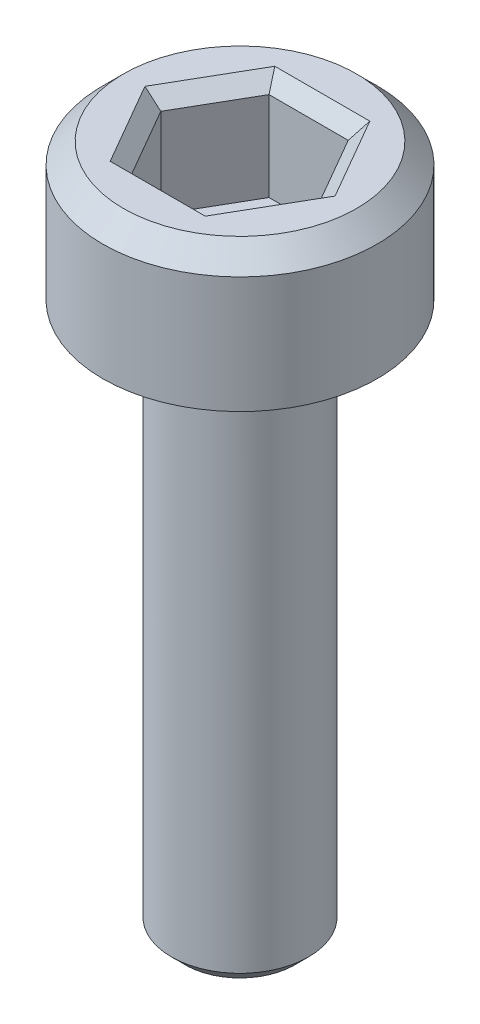
ISO-10303-21;
HEADER;
FILE_DESCRIPTION(('STEP AP214'),'2;1');
FILE_NAME('part.step','',(''),(''),'','','');
FILE_SCHEMA(('AUTOMOTIVE_DESIGN { 1 0 10303 214 1 1 1 1 }'));
ENDSEC;
DATA;
#1=APPLICATION_CONTEXT('core data for automotive mechanical design processes');
#2=APPLICATION_PROTOCOL_DEFINITION('international standard','automotive_design',2000,#1);
#3=PRODUCT_CONTEXT('',#1,'mechanical');
#4=PRODUCT('Part','Part','',(#3));
#5=PRODUCT_RELATED_PRODUCT_CATEGORY('part','',(#4));
#6=PRODUCT_DEFINITION_FORMATION('','',#4);
#7=PRODUCT_DEFINITION_CONTEXT('part definition',#1,'design');
#8=PRODUCT_DEFINITION('design','',#6,#7);
#9=PRODUCT_DEFINITION_SHAPE('','',#8);
#10=(LENGTH_UNIT() NAMED_UNIT(*) SI_UNIT(.MILLI.,.METRE.));
#11=(NAMED_UNIT(*) PLANE_ANGLE_UNIT() SI_UNIT($,.RADIAN.));
#12=(NAMED_UNIT(*) SI_UNIT($,.STERADIAN.) SOLID_ANGLE_UNIT());
#13=UNCERTAINTY_MEASURE_WITH_UNIT(LENGTH_MEASURE(1.E-05),#10,'distance_accuracy_value','');
#14=(GEOMETRIC_REPRESENTATION_CONTEXT(3) GLOBAL_UNCERTAINTY_ASSIGNED_CONTEXT((#13)) GLOBAL_UNIT_ASSIGNED_CONTEXT((#10,
#11,#12)) REPRESENTATION_CONTEXT('',''));
#15=CARTESIAN_POINT('',(0.,0.,0.));
#16=DIRECTION('',(0.,0.,1.));
#17=DIRECTION('',(1.,0.,0.));
#18=AXIS2_PLACEMENT_3D('',#15,#16,#17);
#19=CARTESIAN_POINT('',(0.,0.,0.));
#20=DIRECTION('',(0.,1.,0.));
#21=DIRECTION('',(0.,0.,1.));
#22=AXIS2_PLACEMENT_3D('',#19,#20,#21);
#23=PLANE('',#22);
#24=CARTESIAN_POINT('',(0.,0.,0.));
#25=DIRECTION('',(0.,1.,0.));
#26=DIRECTION('',(0.,0.,1.));
#27=AXIS2_PLACEMENT_3D('',#24,#25,#26);
#28=CIRCLE('',#27,2.);
#29=CARTESIAN_POINT('',(0.,0.,2.));
#30=VERTEX_POINT('',#29);
#31=EDGE_CURVE('E146',#30,#30,#28,.T.);
#32=ORIENTED_EDGE('',*,*,#31,.F.);
#33=EDGE_LOOP('',(#32));
#34=FACE_BOUND('',#33,.T.);
#35=CARTESIAN_POINT('',(0.,0.,0.));
#36=DIRECTION('',(0.,1.,0.));
#37=DIRECTION('',(0.,0.,1.));
#38=AXIS2_PLACEMENT_3D('',#35,#36,#37);
#39=CIRCLE('',#38,1.);
#40=CARTESIAN_POINT('',(0.,0.,1.));
#41=VERTEX_POINT('',#40);
#42=EDGE_CURVE('E185',#41,#41,#39,.F.);
#43=ORIENTED_EDGE('',*,*,#42,.F.);
#44=EDGE_LOOP('',(#43));
#45=FACE_BOUND('',#44,.T.);
#46=ADVANCED_FACE('F33',(#34,#45),#23,.F.);
#47=CARTESIAN_POINT('',(0.,2.,0.));
#48=DIRECTION('',(0.,-1.,0.));
#49=DIRECTION('',(0.,0.,-1.));
#50=AXIS2_PLACEMENT_3D('',#47,#48,#49);
#51=CYLINDRICAL_SURFACE('',#50,2.);
#52=CARTESIAN_POINT('',(0.,1.7,0.));
#53=DIRECTION('',(0.,1.,0.));
#54=DIRECTION('',(0.,0.,1.));
#55=AXIS2_PLACEMENT_3D('',#52,#53,#54);
#56=CIRCLE('',#55,2.);
#57=CARTESIAN_POINT('',(0.,1.7,2.));
#58=VERTEX_POINT('',#57);
#59=EDGE_CURVE('E160',#58,#58,#56,.F.);
#60=ORIENTED_EDGE('',*,*,#59,.T.);
#61=EDGE_LOOP('',(#60));
#62=FACE_BOUND('',#61,.T.);
#63=ORIENTED_EDGE('',*,*,#31,.T.);
#64=EDGE_LOOP('',(#63));
#65=FACE_BOUND('',#64,.T.);
#66=ADVANCED_FACE('F213',(#62,#65),#51,.T.);
#67=CARTESIAN_POINT('',(0.,2.,0.));
#68=DIRECTION('',(0.,1.,0.));
#69=DIRECTION('',(0.,0.,1.));
#70=AXIS2_PLACEMENT_3D('',#67,#68,#69);
#71=PLANE('',#70);
#72=DIRECTION('',(1.,0.,0.));
#73=VECTOR('',#72,1.);
#74=CARTESIAN_POINT('',(0.577350269189625,2.,-1.2));
#75=LINE('',#74,#73);
#76=CARTESIAN_POINT('',(-0.692820323027552,2.,-1.2));
#77=VERTEX_POINT('',#76);
#78=CARTESIAN_POINT('',(0.692820323027551,2.,-1.2));
#79=VERTEX_POINT('',#78);
#80=EDGE_CURVE('E165',#77,#79,#75,.T.);
#81=ORIENTED_EDGE('',*,*,#80,.T.);
#82=DIRECTION('',(0.5,0.,0.866025403784438));
#83=VECTOR('',#82,1.);
#84=CARTESIAN_POINT('',(1.32790561913614,2.,-0.100000000000001));
#85=LINE('',#84,#83);
#86=CARTESIAN_POINT('',(1.3856406460551,2.,0.));
#87=VERTEX_POINT('',#86);
#88=EDGE_CURVE('E175',#79,#87,#85,.T.);
#89=ORIENTED_EDGE('',*,*,#88,.T.);
#90=DIRECTION('',(-0.5,0.,0.866025403784439));
#91=VECTOR('',#90,1.);
#92=CARTESIAN_POINT('',(0.750555349946515,2.,1.1));
#93=LINE('',#92,#91);
#94=CARTESIAN_POINT('',(0.692820323027551,2.,1.2));
#95=VERTEX_POINT('',#94);
#96=EDGE_CURVE('E173',#87,#95,#93,.T.);
#97=ORIENTED_EDGE('',*,*,#96,.T.);
#98=DIRECTION('',(-1.,0.,0.));
#99=VECTOR('',#98,1.);
#100=CARTESIAN_POINT('',(-0.577350269189626,2.,1.2));
#101=LINE('',#100,#99);
#102=CARTESIAN_POINT('',(-0.692820323027551,2.,1.2));
#103=VERTEX_POINT('',#102);
#104=EDGE_CURVE('E171',#95,#103,#101,.T.);
#105=ORIENTED_EDGE('',*,*,#104,.T.);
#106=DIRECTION('',(-0.5,0.,-0.866025403784439));
#107=VECTOR('',#106,1.);
#108=CARTESIAN_POINT('',(-1.32790561913614,2.,0.100000000000001));
#109=LINE('',#108,#107);
#110=CARTESIAN_POINT('',(-1.3856406460551,2.,0.));
#111=VERTEX_POINT('',#110);
#112=EDGE_CURVE('E169',#103,#111,#109,.T.);
#113=ORIENTED_EDGE('',*,*,#112,.T.);
#114=DIRECTION('',(0.5,0.,-0.866025403784439));
#115=VECTOR('',#114,1.);
#116=CARTESIAN_POINT('',(-0.750555349946515,2.,-1.1));
#117=LINE('',#116,#115);
#118=EDGE_CURVE('E167',#111,#77,#117,.T.);
#119=ORIENTED_EDGE('',*,*,#118,.T.);
#120=EDGE_LOOP('',(#81,#89,#97,#105,#113,#119));
#121=FACE_BOUND('',#120,.T.);
#122=CARTESIAN_POINT('',(0.,2.,0.));
#123=DIRECTION('',(0.,1.,0.));
#124=DIRECTION('',(0.,0.,1.));
#125=AXIS2_PLACEMENT_3D('',#122,#123,#124);
#126=CIRCLE('',#125,1.7);
#127=CARTESIAN_POINT('',(0.,2.,1.7));
#128=VERTEX_POINT('',#127);
#129=EDGE_CURVE('E157',#128,#128,#126,.T.);
#130=ORIENTED_EDGE('',*,*,#129,.T.);
#131=EDGE_LOOP('',(#130));
#132=FACE_BOUND('',#131,.T.);
#133=ADVANCED_FACE('F219',(#121,#132),#71,.T.);
#134=CARTESIAN_POINT('',(0.,2.,0.));
#135=DIRECTION('',(0.,-1.,0.));
#136=DIRECTION('',(0.,0.,-1.));
#137=AXIS2_PLACEMENT_3D('',#134,#135,#136);
#138=CONICAL_SURFACE('',#137,1.7,0.785398163397447);
#139=ORIENTED_EDGE('',*,*,#59,.F.);
#140=EDGE_LOOP('',(#139));
#141=FACE_BOUND('',#140,.T.);
#142=ORIENTED_EDGE('',*,*,#129,.F.);
#143=EDGE_LOOP('',(#142));
#144=FACE_BOUND('',#143,.T.);
#145=ADVANCED_FACE('F227',(#141,#144),#138,.T.);
#146=CARTESIAN_POINT('',(0.577350269189626,0.5,1.));
#147=DIRECTION('',(0.866025403784439,0.,0.5));
#148=DIRECTION('',(0.5,0.,-0.866025403784439));
#149=AXIS2_PLACEMENT_3D('',#146,#147,#148);
#150=PLANE('',#149);
#151=DIRECTION('',(0.,1.,0.));
#152=VECTOR('',#151,1.);
#153=CARTESIAN_POINT('',(0.577350269189626,0.5,1.));
#154=LINE('',#153,#152);
#155=CARTESIAN_POINT('',(0.577350269189626,0.5,1.));
#156=VERTEX_POINT('',#155);
#157=CARTESIAN_POINT('',(0.577350269189626,1.8,1.));
#158=VERTEX_POINT('',#157);
#159=EDGE_CURVE('E144',#156,#158,#154,.T.);
#160=ORIENTED_EDGE('',*,*,#159,.T.);
#161=DIRECTION('',(0.5,0.,-0.866025403784439));
#162=VECTOR('',#161,1.);
#163=CARTESIAN_POINT('',(1.15470053837925,1.8,0.));
#164=LINE('',#163,#162);
#165=CARTESIAN_POINT('',(1.15470053837925,1.8,0.));
#166=VERTEX_POINT('',#165);
#167=EDGE_CURVE('E113',#158,#166,#164,.T.);
#168=ORIENTED_EDGE('',*,*,#167,.T.);
#169=DIRECTION('',(0.,1.,0.));
#170=VECTOR('',#169,1.);
#171=CARTESIAN_POINT('',(1.15470053837925,0.5,0.));
#172=LINE('',#171,#170);
#173=CARTESIAN_POINT('',(1.15470053837925,0.5,0.));
#174=VERTEX_POINT('',#173);
#175=EDGE_CURVE('E105',#174,#166,#172,.T.);
#176=ORIENTED_EDGE('',*,*,#175,.F.);
#177=DIRECTION('',(0.5,0.,-0.866025403784439));
#178=VECTOR('',#177,1.);
#179=CARTESIAN_POINT('',(0.577350269189626,0.5,1.));
#180=LINE('',#179,#178);
#181=EDGE_CURVE('E110',#156,#174,#180,.T.);
#182=ORIENTED_EDGE('',*,*,#181,.F.);
#183=EDGE_LOOP('',(#160,#168,#176,#182));
#184=FACE_BOUND('',#183,.T.);
#185=ADVANCED_FACE('F108',(#184),#150,.F.);
#186=CARTESIAN_POINT('',(-0.577350269189626,0.5,1.));
#187=DIRECTION('',(0.,0.,1.));
#188=DIRECTION('',(1.,0.,0.));
#189=AXIS2_PLACEMENT_3D('',#186,#187,#188);
#190=PLANE('',#189);
#191=DIRECTION('',(0.,1.,0.));
#192=VECTOR('',#191,1.);
#193=CARTESIAN_POINT('',(-0.577350269189626,0.5,1.));
#194=LINE('',#193,#192);
#195=CARTESIAN_POINT('',(-0.577350269189626,0.5,1.));
#196=VERTEX_POINT('',#195);
#197=CARTESIAN_POINT('',(-0.577350269189626,1.8,1.));
#198=VERTEX_POINT('',#197);
#199=EDGE_CURVE('E147',#196,#198,#194,.T.);
#200=ORIENTED_EDGE('',*,*,#199,.T.);
#201=DIRECTION('',(1.,0.,0.));
#202=VECTOR('',#201,1.);
#203=CARTESIAN_POINT('',(0.577350269189626,1.8,1.));
#204=LINE('',#203,#202);
#205=EDGE_CURVE('E179',#198,#158,#204,.T.);
#206=ORIENTED_EDGE('',*,*,#205,.T.);
#207=ORIENTED_EDGE('',*,*,#159,.F.);
#208=DIRECTION('',(1.,0.,0.));
#209=VECTOR('',#208,1.);
#210=CARTESIAN_POINT('',(-0.577350269189626,0.5,1.));
#211=LINE('',#210,#209);
#212=EDGE_CURVE('E118',#196,#156,#211,.T.);
#213=ORIENTED_EDGE('',*,*,#212,.F.);
#214=EDGE_LOOP('',(#200,#206,#207,#213));
#215=FACE_BOUND('',#214,.T.);
#216=ADVANCED_FACE('F280',(#215),#190,.F.);
#217=CARTESIAN_POINT('',(-1.15470053837925,0.5,0.));
#218=DIRECTION('',(-0.866025403784438,0.,0.5));
#219=DIRECTION('',(0.5,0.,0.866025403784439));
#220=AXIS2_PLACEMENT_3D('',#217,#218,#219);
#221=PLANE('',#220);
#222=DIRECTION('',(0.,1.,0.));
#223=VECTOR('',#222,1.);
#224=CARTESIAN_POINT('',(-1.15470053837925,0.5,0.));
#225=LINE('',#224,#223);
#226=CARTESIAN_POINT('',(-1.15470053837925,0.5,0.));
#227=VERTEX_POINT('',#226);
#228=CARTESIAN_POINT('',(-1.15470053837925,1.8,0.));
#229=VERTEX_POINT('',#228);
#230=EDGE_CURVE('E150',#227,#229,#225,.T.);
#231=ORIENTED_EDGE('',*,*,#230,.T.);
#232=DIRECTION('',(0.5,0.,0.866025403784439));
#233=VECTOR('',#232,1.);
#234=CARTESIAN_POINT('',(-0.577350269189626,1.8,1.));
#235=LINE('',#234,#233);
#236=EDGE_CURVE('E181',#229,#198,#235,.T.);
#237=ORIENTED_EDGE('',*,*,#236,.T.);
#238=ORIENTED_EDGE('',*,*,#199,.F.);
#239=DIRECTION('',(0.5,0.,0.866025403784439));
#240=VECTOR('',#239,1.);
#241=CARTESIAN_POINT('',(-1.15470053837925,0.5,0.));
#242=LINE('',#241,#240);
#243=EDGE_CURVE('E141',#227,#196,#242,.T.);
#244=ORIENTED_EDGE('',*,*,#243,.F.);
#245=EDGE_LOOP('',(#231,#237,#238,#244));
#246=FACE_BOUND('',#245,.T.);
#247=ADVANCED_FACE('F278',(#246),#221,.F.);
#248=CARTESIAN_POINT('',(-0.577350269189626,0.5,-1.));
#249=DIRECTION('',(-0.866025403784439,0.,-0.5));
#250=DIRECTION('',(-0.5,0.,0.866025403784439));
#251=AXIS2_PLACEMENT_3D('',#248,#249,#250);
#252=PLANE('',#251);
#253=DIRECTION('',(0.,1.,0.));
#254=VECTOR('',#253,1.);
#255=CARTESIAN_POINT('',(-0.577350269189626,0.5,-1.));
#256=LINE('',#255,#254);
#257=CARTESIAN_POINT('',(-0.577350269189626,0.5,-1.));
#258=VERTEX_POINT('',#257);
#259=CARTESIAN_POINT('',(-0.577350269189626,1.8,-1.));
#260=VERTEX_POINT('',#259);
#261=EDGE_CURVE('E152',#258,#260,#256,.T.);
#262=ORIENTED_EDGE('',*,*,#261,.T.);
#263=DIRECTION('',(-0.5,0.,0.866025403784439));
#264=VECTOR('',#263,1.);
#265=CARTESIAN_POINT('',(-1.15470053837925,1.8,0.));
#266=LINE('',#265,#264);
#267=EDGE_CURVE('E55',#260,#229,#266,.T.);
#268=ORIENTED_EDGE('',*,*,#267,.T.);
#269=ORIENTED_EDGE('',*,*,#230,.F.);
#270=DIRECTION('',(-0.5,0.,0.866025403784439));
#271=VECTOR('',#270,1.);
#272=CARTESIAN_POINT('',(-0.577350269189626,0.5,-1.));
#273=LINE('',#272,#271);
#274=EDGE_CURVE('E138',#258,#227,#273,.T.);
#275=ORIENTED_EDGE('',*,*,#274,.F.);
#276=EDGE_LOOP('',(#262,#268,#269,#275));
#277=FACE_BOUND('',#276,.T.);
#278=ADVANCED_FACE('F276',(#277),#252,.F.);
#279=CARTESIAN_POINT('',(0.577350269189625,0.5,-1.));
#280=DIRECTION('',(0.,0.,-1.));
#281=DIRECTION('',(-1.,0.,0.));
#282=AXIS2_PLACEMENT_3D('',#279,#280,#281);
#283=PLANE('',#282);
#284=DIRECTION('',(0.,1.,0.));
#285=VECTOR('',#284,1.);
#286=CARTESIAN_POINT('',(0.577350269189625,0.5,-1.));
#287=LINE('',#286,#285);
#288=CARTESIAN_POINT('',(0.577350269189625,0.5,-1.));
#289=VERTEX_POINT('',#288);
#290=CARTESIAN_POINT('',(0.577350269189625,1.8,-1.));
#291=VERTEX_POINT('',#290);
#292=EDGE_CURVE('E117',#289,#291,#287,.T.);
#293=ORIENTED_EDGE('',*,*,#292,.T.);
#294=DIRECTION('',(-1.,0.,0.));
#295=VECTOR('',#294,1.);
#296=CARTESIAN_POINT('',(-0.577350269189626,1.8,-1.));
#297=LINE('',#296,#295);
#298=EDGE_CURVE('E48',#291,#260,#297,.T.);
#299=ORIENTED_EDGE('',*,*,#298,.T.);
#300=ORIENTED_EDGE('',*,*,#261,.F.);
#301=DIRECTION('',(-1.,0.,0.));
#302=VECTOR('',#301,1.);
#303=CARTESIAN_POINT('',(0.577350269189625,0.5,-1.));
#304=LINE('',#303,#302);
#305=EDGE_CURVE('E126',#289,#258,#304,.T.);
#306=ORIENTED_EDGE('',*,*,#305,.F.);
#307=EDGE_LOOP('',(#293,#299,#300,#306));
#308=FACE_BOUND('',#307,.T.);
#309=ADVANCED_FACE('F273',(#308),#283,.F.);
#310=CARTESIAN_POINT('',(1.15470053837925,0.5,0.));
#311=DIRECTION('',(0.866025403784438,0.,-0.5));
#312=DIRECTION('',(-0.5,0.,-0.866025403784439));
#313=AXIS2_PLACEMENT_3D('',#310,#311,#312);
#314=PLANE('',#313);
#315=ORIENTED_EDGE('',*,*,#175,.T.);
#316=DIRECTION('',(-0.5,0.,-0.866025403784439));
#317=VECTOR('',#316,1.);
#318=CARTESIAN_POINT('',(0.577350269189625,1.8,-1.));
#319=LINE('',#318,#317);
#320=EDGE_CURVE('E163',#166,#291,#319,.T.);
#321=ORIENTED_EDGE('',*,*,#320,.T.);
#322=ORIENTED_EDGE('',*,*,#292,.F.);
#323=DIRECTION('',(-0.5,0.,-0.866025403784438));
#324=VECTOR('',#323,1.);
#325=CARTESIAN_POINT('',(1.15470053837925,0.5,0.));
#326=LINE('',#325,#324);
#327=EDGE_CURVE('E121',#174,#289,#326,.T.);
#328=ORIENTED_EDGE('',*,*,#327,.F.);
#329=EDGE_LOOP('',(#315,#321,#322,#328));
#330=FACE_BOUND('',#329,.T.);
#331=ADVANCED_FACE('F122',(#330),#314,.F.);
#332=CARTESIAN_POINT('',(0.,0.5,0.));
#333=DIRECTION('',(0.,1.,0.));
#334=DIRECTION('',(0.,0.,1.));
#335=AXIS2_PLACEMENT_3D('',#332,#333,#334);
#336=PLANE('',#335);
#337=ORIENTED_EDGE('',*,*,#181,.T.);
#338=ORIENTED_EDGE('',*,*,#327,.T.);
#339=ORIENTED_EDGE('',*,*,#305,.T.);
#340=ORIENTED_EDGE('',*,*,#274,.T.);
#341=ORIENTED_EDGE('',*,*,#243,.T.);
#342=ORIENTED_EDGE('',*,*,#212,.T.);
#343=EDGE_LOOP('',(#337,#338,#339,#340,#341,#342));
#344=FACE_BOUND('',#343,.T.);
#345=ADVANCED_FACE('F128',(#344),#336,.T.);
#346=CARTESIAN_POINT('',(-1.15470053837925,1.8,0.));
#347=DIRECTION('',(0.612372435695792,0.70710678118655,-0.353553390593273));
#348=DIRECTION('',(-0.5,0.,-0.866025403784439));
#349=AXIS2_PLACEMENT_3D('',#346,#347,#348);
#350=PLANE('',#349);
#351=DIRECTION('',(0.755928946018457,-0.654653670707974,0.));
#352=VECTOR('',#351,1.);
#353=CARTESIAN_POINT('',(-1.15470053837925,1.8,0.));
#354=LINE('',#353,#352);
#355=EDGE_CURVE('E134',#111,#229,#354,.T.);
#356=ORIENTED_EDGE('',*,*,#355,.F.);
#357=ORIENTED_EDGE('',*,*,#112,.F.);
#358=DIRECTION('',(0.377964473009227,-0.654653670707974,-0.654653670707981));
#359=VECTOR('',#358,1.);
#360=CARTESIAN_POINT('',(-0.577350269189626,1.8,1.));
#361=LINE('',#360,#359);
#362=EDGE_CURVE('E131',#198,#103,#361,.F.);
#363=ORIENTED_EDGE('',*,*,#362,.F.);
#364=ORIENTED_EDGE('',*,*,#236,.F.);
#365=EDGE_LOOP('',(#356,#357,#363,#364));
#366=FACE_BOUND('',#365,.T.);
#367=ADVANCED_FACE('F249',(#366),#350,.T.);
#368=CARTESIAN_POINT('',(-0.577350269189626,1.8,1.));
#369=DIRECTION('',(0.,0.707106781186551,-0.707106781186544));
#370=DIRECTION('',(-1.,0.,0.));
#371=AXIS2_PLACEMENT_3D('',#368,#369,#370);
#372=PLANE('',#371);
#373=ORIENTED_EDGE('',*,*,#362,.T.);
#374=ORIENTED_EDGE('',*,*,#104,.F.);
#375=DIRECTION('',(-0.377964473009228,-0.654653670707974,-0.654653670707981));
#376=VECTOR('',#375,1.);
#377=CARTESIAN_POINT('',(0.577350269189626,1.8,1.));
#378=LINE('',#377,#376);
#379=EDGE_CURVE('E193',#158,#95,#378,.F.);
#380=ORIENTED_EDGE('',*,*,#379,.F.);
#381=ORIENTED_EDGE('',*,*,#205,.F.);
#382=EDGE_LOOP('',(#373,#374,#380,#381));
#383=FACE_BOUND('',#382,.T.);
#384=ADVANCED_FACE('F246',(#383),#372,.T.);
#385=CARTESIAN_POINT('',(-0.577350269189626,1.8,-1.));
#386=DIRECTION('',(0.612372435695792,0.70710678118655,0.353553390593272));
#387=DIRECTION('',(0.5,0.,-0.866025403784439));
#388=AXIS2_PLACEMENT_3D('',#385,#386,#387);
#389=PLANE('',#388);
#390=ORIENTED_EDGE('',*,*,#355,.T.);
#391=ORIENTED_EDGE('',*,*,#267,.F.);
#392=DIRECTION('',(0.377964473009228,-0.654653670707974,0.65465367070798));
#393=VECTOR('',#392,1.);
#394=CARTESIAN_POINT('',(-0.577350269189626,1.8,-1.));
#395=LINE('',#394,#393);
#396=EDGE_CURVE('E190',#77,#260,#395,.T.);
#397=ORIENTED_EDGE('',*,*,#396,.F.);
#398=ORIENTED_EDGE('',*,*,#118,.F.);
#399=EDGE_LOOP('',(#390,#391,#397,#398));
#400=FACE_BOUND('',#399,.T.);
#401=ADVANCED_FACE('F242',(#400),#389,.T.);
#402=CARTESIAN_POINT('',(0.577350269189626,1.8,1.));
#403=DIRECTION('',(-0.612372435695792,0.70710678118655,-0.353553390593272));
#404=DIRECTION('',(-0.5,0.,0.866025403784439));
#405=AXIS2_PLACEMENT_3D('',#402,#403,#404);
#406=PLANE('',#405);
#407=ORIENTED_EDGE('',*,*,#379,.T.);
#408=ORIENTED_EDGE('',*,*,#96,.F.);
#409=DIRECTION('',(-0.755928946018457,-0.654653670707974,0.));
#410=VECTOR('',#409,1.);
#411=CARTESIAN_POINT('',(1.15470053837925,1.8,0.));
#412=LINE('',#411,#410);
#413=EDGE_CURVE('E188',#166,#87,#412,.F.);
#414=ORIENTED_EDGE('',*,*,#413,.F.);
#415=ORIENTED_EDGE('',*,*,#167,.F.);
#416=EDGE_LOOP('',(#407,#408,#414,#415));
#417=FACE_BOUND('',#416,.T.);
#418=ADVANCED_FACE('F238',(#417),#406,.T.);
#419=CARTESIAN_POINT('',(0.577350269189625,1.8,-1.));
#420=DIRECTION('',(0.,0.707106781186551,0.707106781186544));
#421=DIRECTION('',(1.,0.,0.));
#422=AXIS2_PLACEMENT_3D('',#419,#420,#421);
#423=PLANE('',#422);
#424=ORIENTED_EDGE('',*,*,#396,.T.);
#425=ORIENTED_EDGE('',*,*,#298,.F.);
#426=DIRECTION('',(0.377964473009229,0.654653670707974,-0.65465367070798));
#427=VECTOR('',#426,1.);
#428=CARTESIAN_POINT('',(0.41239304942116,1.51428571428571,-0.714285714285713));
#429=LINE('',#428,#427);
#430=EDGE_CURVE('E186',#79,#291,#429,.F.);
#431=ORIENTED_EDGE('',*,*,#430,.F.);
#432=ORIENTED_EDGE('',*,*,#80,.F.);
#433=EDGE_LOOP('',(#424,#425,#431,#432));
#434=FACE_BOUND('',#433,.T.);
#435=ADVANCED_FACE('F234',(#434),#423,.T.);
#436=CARTESIAN_POINT('',(1.15470053837925,1.8,0.));
#437=DIRECTION('',(-0.612372435695792,0.707106781186551,0.353553390593272));
#438=DIRECTION('',(0.5,0.,0.866025403784439));
#439=AXIS2_PLACEMENT_3D('',#436,#437,#438);
#440=PLANE('',#439);
#441=ORIENTED_EDGE('',*,*,#413,.T.);
#442=ORIENTED_EDGE('',*,*,#88,.F.);
#443=ORIENTED_EDGE('',*,*,#430,.T.);
#444=ORIENTED_EDGE('',*,*,#320,.F.);
#445=EDGE_LOOP('',(#441,#442,#443,#444));
#446=FACE_BOUND('',#445,.T.);
#447=ADVANCED_FACE('F231',(#446),#440,.T.);
#448=CARTESIAN_POINT('',(0.,-8.,0.));
#449=DIRECTION('',(0.,1.,0.));
#450=DIRECTION('',(0.,0.,1.));
#451=AXIS2_PLACEMENT_3D('',#448,#449,#450);
#452=CYLINDRICAL_SURFACE('',#451,1.);
#453=CARTESIAN_POINT('',(0.,-7.8,0.));
#454=DIRECTION('',(0.,-1.,0.));
#455=DIRECTION('',(0.,0.,-1.));
#456=AXIS2_PLACEMENT_3D('',#453,#454,#455);
#457=CIRCLE('',#456,1.);
#458=CARTESIAN_POINT('',(0.,-7.8,-1.));
#459=VERTEX_POINT('',#458);
#460=EDGE_CURVE('E11',#459,#459,#457,.F.);
#461=ORIENTED_EDGE('',*,*,#460,.T.);
#462=EDGE_LOOP('',(#461));
#463=FACE_BOUND('',#462,.T.);
#464=ORIENTED_EDGE('',*,*,#42,.T.);
#465=EDGE_LOOP('',(#464));
#466=FACE_BOUND('',#465,.T.);
#467=ADVANCED_FACE('F209',(#463,#466),#452,.T.);
#468=CARTESIAN_POINT('',(0.,-8.,0.));
#469=DIRECTION('',(0.,-1.,0.));
#470=DIRECTION('',(0.,0.,-1.));
#471=AXIS2_PLACEMENT_3D('',#468,#469,#470);
#472=PLANE('',#471);
#473=CARTESIAN_POINT('',(0.,-8.,0.));
#474=DIRECTION('',(0.,-1.,0.));
#475=DIRECTION('',(0.,0.,-1.));
#476=AXIS2_PLACEMENT_3D('',#473,#474,#475);
#477=CIRCLE('',#476,0.8);
#478=CARTESIAN_POINT('',(0.,-8.,-0.8));
#479=VERTEX_POINT('',#478);
#480=EDGE_CURVE('E41',#479,#479,#477,.T.);
#481=ORIENTED_EDGE('',*,*,#480,.T.);
#482=EDGE_LOOP('',(#481));
#483=FACE_BOUND('',#482,.T.);
#484=ADVANCED_FACE('F202',(#483),#472,.T.);
#485=CARTESIAN_POINT('',(0.,-8.,0.));
#486=DIRECTION('',(0.,1.,0.));
#487=DIRECTION('',(0.,0.,1.));
#488=AXIS2_PLACEMENT_3D('',#485,#486,#487);
#489=CONICAL_SURFACE('',#488,0.8,0.785398163397446);
#490=ORIENTED_EDGE('',*,*,#460,.F.);
#491=EDGE_LOOP('',(#490));
#492=FACE_BOUND('',#491,.T.);
#493=ORIENTED_EDGE('',*,*,#480,.F.);
#494=EDGE_LOOP('',(#493));
#495=FACE_BOUND('',#494,.T.);
#496=ADVANCED_FACE('F35',(#492,#495),#489,.T.);
#497=CLOSED_SHELL('',(#46,#66,#133,#145,#185,#216,#247,#278,#309,#331,#345,#367,#384,#401,#418,
#435,#447,#467,#484,#496));
#498=MANIFOLD_SOLID_BREP('B2',#497);
#499=ADVANCED_BREP_SHAPE_REPRESENTATION('',(#18,#498),#14);
#500=SHAPE_DEFINITION_REPRESENTATION(#9,#499);
ENDSEC;
END-ISO-10303-21;
